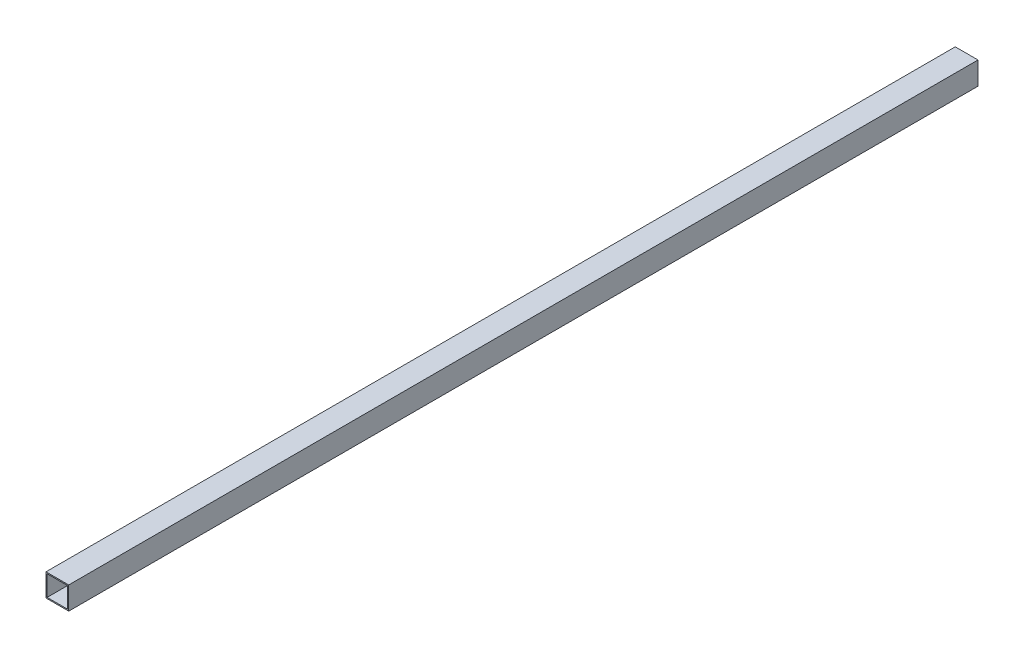
ISO-10303-21;
HEADER;
FILE_DESCRIPTION(('STEP AP214'),'2;1');
FILE_NAME('part.step','',(''),(''),'','','');
FILE_SCHEMA(('AUTOMOTIVE_DESIGN { 1 0 10303 214 1 1 1 1 }'));
ENDSEC;
DATA;
#1=APPLICATION_CONTEXT('core data for automotive mechanical design processes');
#2=APPLICATION_PROTOCOL_DEFINITION('international standard','automotive_design',2000,#1);
#3=PRODUCT_CONTEXT('',#1,'mechanical');
#4=PRODUCT('Part','Part','',(#3));
#5=PRODUCT_RELATED_PRODUCT_CATEGORY('part','',(#4));
#6=PRODUCT_DEFINITION_FORMATION('','',#4);
#7=PRODUCT_DEFINITION_CONTEXT('part definition',#1,'design');
#8=PRODUCT_DEFINITION('design','',#6,#7);
#9=PRODUCT_DEFINITION_SHAPE('','',#8);
#10=(LENGTH_UNIT() NAMED_UNIT(*) SI_UNIT(.MILLI.,.METRE.));
#11=(NAMED_UNIT(*) PLANE_ANGLE_UNIT() SI_UNIT($,.RADIAN.));
#12=(NAMED_UNIT(*) SI_UNIT($,.STERADIAN.) SOLID_ANGLE_UNIT());
#13=UNCERTAINTY_MEASURE_WITH_UNIT(LENGTH_MEASURE(1.E-05),#10,'distance_accuracy_value','');
#14=(GEOMETRIC_REPRESENTATION_CONTEXT(3) GLOBAL_UNCERTAINTY_ASSIGNED_CONTEXT((#13)) GLOBAL_UNIT_ASSIGNED_CONTEXT((#10,
#11,#12)) REPRESENTATION_CONTEXT('',''));
#15=CARTESIAN_POINT('',(0.,0.,0.));
#16=DIRECTION('',(0.,0.,1.));
#17=DIRECTION('',(1.,0.,0.));
#18=AXIS2_PLACEMENT_3D('',#15,#16,#17);
#19=CARTESIAN_POINT('',(0.,0.,400.));
#20=DIRECTION('',(0.,0.,1.));
#21=DIRECTION('',(1.,0.,0.));
#22=AXIS2_PLACEMENT_3D('',#19,#20,#21);
#23=PLANE('',#22);
#24=DIRECTION('',(0.,-1.,0.));
#25=VECTOR('',#24,1.);
#26=CARTESIAN_POINT('',(-5.,-5.,400.));
#27=LINE('',#26,#25);
#28=CARTESIAN_POINT('',(-5.,5.,400.));
#29=VERTEX_POINT('',#28);
#30=CARTESIAN_POINT('',(-5.,-5.,400.));
#31=VERTEX_POINT('',#30);
#32=EDGE_CURVE('E136',#29,#31,#27,.T.);
#33=ORIENTED_EDGE('',*,*,#32,.T.);
#34=DIRECTION('',(1.,0.,0.));
#35=VECTOR('',#34,1.);
#36=CARTESIAN_POINT('',(5.,-5.,400.));
#37=LINE('',#36,#35);
#38=CARTESIAN_POINT('',(5.,-5.,400.));
#39=VERTEX_POINT('',#38);
#40=EDGE_CURVE('E139',#31,#39,#37,.T.);
#41=ORIENTED_EDGE('',*,*,#40,.T.);
#42=DIRECTION('',(0.,1.,0.));
#43=VECTOR('',#42,1.);
#44=CARTESIAN_POINT('',(5.,-5.,400.));
#45=LINE('',#44,#43);
#46=CARTESIAN_POINT('',(5.,5.,400.));
#47=VERTEX_POINT('',#46);
#48=EDGE_CURVE('E142',#39,#47,#45,.T.);
#49=ORIENTED_EDGE('',*,*,#48,.T.);
#50=DIRECTION('',(-1.,0.,0.));
#51=VECTOR('',#50,1.);
#52=CARTESIAN_POINT('',(5.,5.,400.));
#53=LINE('',#52,#51);
#54=EDGE_CURVE('E144',#47,#29,#53,.T.);
#55=ORIENTED_EDGE('',*,*,#54,.T.);
#56=EDGE_LOOP('',(#33,#41,#49,#55));
#57=FACE_BOUND('',#56,.T.);
#58=DIRECTION('',(1.,0.,0.));
#59=VECTOR('',#58,1.);
#60=CARTESIAN_POINT('',(4.5,-4.5,400.));
#61=LINE('',#60,#59);
#62=CARTESIAN_POINT('',(-4.5,-4.5,400.));
#63=VERTEX_POINT('',#62);
#64=CARTESIAN_POINT('',(4.5,-4.5,400.));
#65=VERTEX_POINT('',#64);
#66=EDGE_CURVE('E108',#63,#65,#61,.T.);
#67=ORIENTED_EDGE('',*,*,#66,.F.);
#68=DIRECTION('',(0.,-1.,0.));
#69=VECTOR('',#68,1.);
#70=CARTESIAN_POINT('',(-4.5,-4.5,400.));
#71=LINE('',#70,#69);
#72=CARTESIAN_POINT('',(-4.5,4.5,400.));
#73=VERTEX_POINT('',#72);
#74=EDGE_CURVE('E100',#73,#63,#71,.T.);
#75=ORIENTED_EDGE('',*,*,#74,.F.);
#76=DIRECTION('',(-1.,0.,0.));
#77=VECTOR('',#76,1.);
#78=CARTESIAN_POINT('',(4.5,4.5,400.));
#79=LINE('',#78,#77);
#80=CARTESIAN_POINT('',(4.5,4.5,400.));
#81=VERTEX_POINT('',#80);
#82=EDGE_CURVE('E122',#81,#73,#79,.T.);
#83=ORIENTED_EDGE('',*,*,#82,.F.);
#84=DIRECTION('',(0.,1.,0.));
#85=VECTOR('',#84,1.);
#86=CARTESIAN_POINT('',(4.5,-4.5,400.));
#87=LINE('',#86,#85);
#88=EDGE_CURVE('E120',#65,#81,#87,.T.);
#89=ORIENTED_EDGE('',*,*,#88,.F.);
#90=EDGE_LOOP('',(#67,#75,#83,#89));
#91=FACE_BOUND('',#90,.T.);
#92=ADVANCED_FACE('F35',(#57,#91),#23,.T.);
#93=CARTESIAN_POINT('',(0.,0.,0.));
#94=DIRECTION('',(0.,0.,1.));
#95=DIRECTION('',(1.,0.,0.));
#96=AXIS2_PLACEMENT_3D('',#93,#94,#95);
#97=PLANE('',#96);
#98=DIRECTION('',(0.,-1.,0.));
#99=VECTOR('',#98,1.);
#100=CARTESIAN_POINT('',(-5.,-5.,0.));
#101=LINE('',#100,#99);
#102=CARTESIAN_POINT('',(-5.,5.,0.));
#103=VERTEX_POINT('',#102);
#104=CARTESIAN_POINT('',(-5.,-5.,0.));
#105=VERTEX_POINT('',#104);
#106=EDGE_CURVE('E116',#103,#105,#101,.T.);
#107=ORIENTED_EDGE('',*,*,#106,.F.);
#108=DIRECTION('',(-1.,0.,0.));
#109=VECTOR('',#108,1.);
#110=CARTESIAN_POINT('',(5.,5.,0.));
#111=LINE('',#110,#109);
#112=CARTESIAN_POINT('',(5.,5.,0.));
#113=VERTEX_POINT('',#112);
#114=EDGE_CURVE('E140',#113,#103,#111,.T.);
#115=ORIENTED_EDGE('',*,*,#114,.F.);
#116=DIRECTION('',(0.,1.,0.));
#117=VECTOR('',#116,1.);
#118=CARTESIAN_POINT('',(5.,-5.,0.));
#119=LINE('',#118,#117);
#120=CARTESIAN_POINT('',(5.,-5.,0.));
#121=VERTEX_POINT('',#120);
#122=EDGE_CURVE('E151',#121,#113,#119,.T.);
#123=ORIENTED_EDGE('',*,*,#122,.F.);
#124=DIRECTION('',(1.,0.,0.));
#125=VECTOR('',#124,1.);
#126=CARTESIAN_POINT('',(5.,-5.,0.));
#127=LINE('',#126,#125);
#128=EDGE_CURVE('E149',#105,#121,#127,.T.);
#129=ORIENTED_EDGE('',*,*,#128,.F.);
#130=EDGE_LOOP('',(#107,#115,#123,#129));
#131=FACE_BOUND('',#130,.T.);
#132=DIRECTION('',(0.,-1.,0.));
#133=VECTOR('',#132,1.);
#134=CARTESIAN_POINT('',(-4.5,-4.5,0.));
#135=LINE('',#134,#133);
#136=CARTESIAN_POINT('',(-4.5,4.5,0.));
#137=VERTEX_POINT('',#136);
#138=CARTESIAN_POINT('',(-4.5,-4.5,0.));
#139=VERTEX_POINT('',#138);
#140=EDGE_CURVE('E58',#137,#139,#135,.T.);
#141=ORIENTED_EDGE('',*,*,#140,.T.);
#142=DIRECTION('',(1.,0.,0.));
#143=VECTOR('',#142,1.);
#144=CARTESIAN_POINT('',(4.5,-4.5,0.));
#145=LINE('',#144,#143);
#146=CARTESIAN_POINT('',(4.5,-4.5,0.));
#147=VERTEX_POINT('',#146);
#148=EDGE_CURVE('E115',#139,#147,#145,.T.);
#149=ORIENTED_EDGE('',*,*,#148,.T.);
#150=DIRECTION('',(0.,1.,0.));
#151=VECTOR('',#150,1.);
#152=CARTESIAN_POINT('',(4.5,-4.5,0.));
#153=LINE('',#152,#151);
#154=CARTESIAN_POINT('',(4.5,4.5,0.));
#155=VERTEX_POINT('',#154);
#156=EDGE_CURVE('E128',#147,#155,#153,.T.);
#157=ORIENTED_EDGE('',*,*,#156,.T.);
#158=DIRECTION('',(-1.,0.,0.));
#159=VECTOR('',#158,1.);
#160=CARTESIAN_POINT('',(4.5,4.5,0.));
#161=LINE('',#160,#159);
#162=EDGE_CURVE('E109',#155,#137,#161,.T.);
#163=ORIENTED_EDGE('',*,*,#162,.T.);
#164=EDGE_LOOP('',(#141,#149,#157,#163));
#165=FACE_BOUND('',#164,.T.);
#166=ADVANCED_FACE('F169',(#131,#165),#97,.F.);
#167=CARTESIAN_POINT('',(-5.,-5.,400.));
#168=DIRECTION('',(1.,0.,0.));
#169=DIRECTION('',(0.,0.,-1.));
#170=AXIS2_PLACEMENT_3D('',#167,#168,#169);
#171=PLANE('',#170);
#172=ORIENTED_EDGE('',*,*,#106,.T.);
#173=DIRECTION('',(0.,0.,-1.));
#174=VECTOR('',#173,1.);
#175=CARTESIAN_POINT('',(-5.,-5.,400.));
#176=LINE('',#175,#174);
#177=EDGE_CURVE('E11',#31,#105,#176,.T.);
#178=ORIENTED_EDGE('',*,*,#177,.F.);
#179=ORIENTED_EDGE('',*,*,#32,.F.);
#180=DIRECTION('',(0.,0.,-1.));
#181=VECTOR('',#180,1.);
#182=CARTESIAN_POINT('',(-5.,5.,400.));
#183=LINE('',#182,#181);
#184=EDGE_CURVE('E146',#29,#103,#183,.T.);
#185=ORIENTED_EDGE('',*,*,#184,.T.);
#186=EDGE_LOOP('',(#172,#178,#179,#185));
#187=FACE_BOUND('',#186,.T.);
#188=ADVANCED_FACE('F37',(#187),#171,.F.);
#189=CARTESIAN_POINT('',(5.,-5.,400.));
#190=DIRECTION('',(0.,1.,0.));
#191=DIRECTION('',(0.,0.,1.));
#192=AXIS2_PLACEMENT_3D('',#189,#190,#191);
#193=PLANE('',#192);
#194=ORIENTED_EDGE('',*,*,#128,.T.);
#195=DIRECTION('',(0.,0.,-1.));
#196=VECTOR('',#195,1.);
#197=CARTESIAN_POINT('',(5.,-5.,400.));
#198=LINE('',#197,#196);
#199=EDGE_CURVE('E43',#39,#121,#198,.T.);
#200=ORIENTED_EDGE('',*,*,#199,.F.);
#201=ORIENTED_EDGE('',*,*,#40,.F.);
#202=ORIENTED_EDGE('',*,*,#177,.T.);
#203=EDGE_LOOP('',(#194,#200,#201,#202));
#204=FACE_BOUND('',#203,.T.);
#205=ADVANCED_FACE('F179',(#204),#193,.F.);
#206=CARTESIAN_POINT('',(5.,-5.,400.));
#207=DIRECTION('',(-1.,0.,0.));
#208=DIRECTION('',(0.,0.,1.));
#209=AXIS2_PLACEMENT_3D('',#206,#207,#208);
#210=PLANE('',#209);
#211=ORIENTED_EDGE('',*,*,#122,.T.);
#212=DIRECTION('',(0.,0.,-1.));
#213=VECTOR('',#212,1.);
#214=CARTESIAN_POINT('',(5.,5.,400.));
#215=LINE('',#214,#213);
#216=EDGE_CURVE('E156',#47,#113,#215,.T.);
#217=ORIENTED_EDGE('',*,*,#216,.F.);
#218=ORIENTED_EDGE('',*,*,#48,.F.);
#219=ORIENTED_EDGE('',*,*,#199,.T.);
#220=EDGE_LOOP('',(#211,#217,#218,#219));
#221=FACE_BOUND('',#220,.T.);
#222=ADVANCED_FACE('F163',(#221),#210,.F.);
#223=CARTESIAN_POINT('',(5.,5.,400.));
#224=DIRECTION('',(0.,-1.,0.));
#225=DIRECTION('',(1.,0.,0.));
#226=AXIS2_PLACEMENT_3D('',#223,#224,#225);
#227=PLANE('',#226);
#228=ORIENTED_EDGE('',*,*,#114,.T.);
#229=ORIENTED_EDGE('',*,*,#184,.F.);
#230=ORIENTED_EDGE('',*,*,#54,.F.);
#231=ORIENTED_EDGE('',*,*,#216,.T.);
#232=EDGE_LOOP('',(#228,#229,#230,#231));
#233=FACE_BOUND('',#232,.T.);
#234=ADVANCED_FACE('F173',(#233),#227,.F.);
#235=CARTESIAN_POINT('',(-4.5,-4.5,400.));
#236=DIRECTION('',(1.,0.,0.));
#237=DIRECTION('',(0.,0.,-1.));
#238=AXIS2_PLACEMENT_3D('',#235,#236,#237);
#239=PLANE('',#238);
#240=ORIENTED_EDGE('',*,*,#140,.F.);
#241=DIRECTION('',(0.,0.,-1.));
#242=VECTOR('',#241,1.);
#243=CARTESIAN_POINT('',(-4.5,4.5,400.));
#244=LINE('',#243,#242);
#245=EDGE_CURVE('E104',#73,#137,#244,.T.);
#246=ORIENTED_EDGE('',*,*,#245,.F.);
#247=ORIENTED_EDGE('',*,*,#74,.T.);
#248=DIRECTION('',(0.,0.,-1.));
#249=VECTOR('',#248,1.);
#250=CARTESIAN_POINT('',(-4.5,-4.5,400.));
#251=LINE('',#250,#249);
#252=EDGE_CURVE('E103',#63,#139,#251,.T.);
#253=ORIENTED_EDGE('',*,*,#252,.T.);
#254=EDGE_LOOP('',(#240,#246,#247,#253));
#255=FACE_BOUND('',#254,.T.);
#256=ADVANCED_FACE('F102',(#255),#239,.T.);
#257=CARTESIAN_POINT('',(4.5,-4.5,400.));
#258=DIRECTION('',(0.,1.,0.));
#259=DIRECTION('',(-1.,0.,0.));
#260=AXIS2_PLACEMENT_3D('',#257,#258,#259);
#261=PLANE('',#260);
#262=ORIENTED_EDGE('',*,*,#148,.F.);
#263=ORIENTED_EDGE('',*,*,#252,.F.);
#264=ORIENTED_EDGE('',*,*,#66,.T.);
#265=DIRECTION('',(0.,0.,-1.));
#266=VECTOR('',#265,1.);
#267=CARTESIAN_POINT('',(4.5,-4.5,400.));
#268=LINE('',#267,#266);
#269=EDGE_CURVE('E117',#65,#147,#268,.T.);
#270=ORIENTED_EDGE('',*,*,#269,.T.);
#271=EDGE_LOOP('',(#262,#263,#264,#270));
#272=FACE_BOUND('',#271,.T.);
#273=ADVANCED_FACE('F112',(#272),#261,.T.);
#274=CARTESIAN_POINT('',(4.5,-4.5,400.));
#275=DIRECTION('',(-1.,0.,0.));
#276=DIRECTION('',(0.,0.,1.));
#277=AXIS2_PLACEMENT_3D('',#274,#275,#276);
#278=PLANE('',#277);
#279=ORIENTED_EDGE('',*,*,#156,.F.);
#280=ORIENTED_EDGE('',*,*,#269,.F.);
#281=ORIENTED_EDGE('',*,*,#88,.T.);
#282=DIRECTION('',(0.,0.,-1.));
#283=VECTOR('',#282,1.);
#284=CARTESIAN_POINT('',(4.5,4.5,400.));
#285=LINE('',#284,#283);
#286=EDGE_CURVE('E50',#81,#155,#285,.T.);
#287=ORIENTED_EDGE('',*,*,#286,.T.);
#288=EDGE_LOOP('',(#279,#280,#281,#287));
#289=FACE_BOUND('',#288,.T.);
#290=ADVANCED_FACE('F202',(#289),#278,.T.);
#291=CARTESIAN_POINT('',(4.5,4.5,400.));
#292=DIRECTION('',(0.,-1.,0.));
#293=DIRECTION('',(1.,0.,0.));
#294=AXIS2_PLACEMENT_3D('',#291,#292,#293);
#295=PLANE('',#294);
#296=ORIENTED_EDGE('',*,*,#162,.F.);
#297=ORIENTED_EDGE('',*,*,#286,.F.);
#298=ORIENTED_EDGE('',*,*,#82,.T.);
#299=ORIENTED_EDGE('',*,*,#245,.T.);
#300=EDGE_LOOP('',(#296,#297,#298,#299));
#301=FACE_BOUND('',#300,.T.);
#302=ADVANCED_FACE('F206',(#301),#295,.T.);
#303=CLOSED_SHELL('',(#92,#166,#188,#205,#222,#234,#256,#273,#290,#302));
#304=MANIFOLD_SOLID_BREP('B2',#303);
#305=ADVANCED_BREP_SHAPE_REPRESENTATION('',(#18,#304),#14);
#306=SHAPE_DEFINITION_REPRESENTATION(#9,#305);
ENDSEC;
END-ISO-10303-21;
